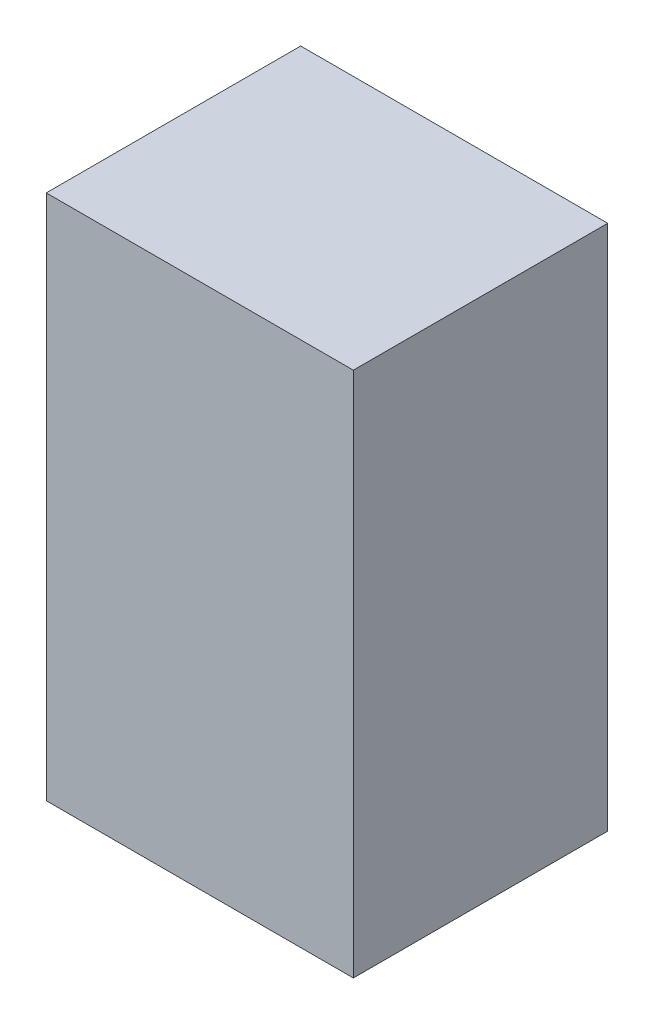
ISO-10303-21;
HEADER;
FILE_DESCRIPTION(('STEP AP214'),'2;1');
FILE_NAME('part.step','',(''),(''),'','','');
FILE_SCHEMA(('AUTOMOTIVE_DESIGN { 1 0 10303 214 1 1 1 1 }'));
ENDSEC;
DATA;
#1=APPLICATION_CONTEXT('core data for automotive mechanical design processes');
#2=APPLICATION_PROTOCOL_DEFINITION('international standard','automotive_design',2000,#1);
#3=PRODUCT_CONTEXT('',#1,'mechanical');
#4=PRODUCT('Part','Part','',(#3));
#5=PRODUCT_RELATED_PRODUCT_CATEGORY('part','',(#4));
#6=PRODUCT_DEFINITION_FORMATION('','',#4);
#7=PRODUCT_DEFINITION_CONTEXT('part definition',#1,'design');
#8=PRODUCT_DEFINITION('design','',#6,#7);
#9=PRODUCT_DEFINITION_SHAPE('','',#8);
#10=(LENGTH_UNIT() NAMED_UNIT(*) SI_UNIT(.MILLI.,.METRE.));
#11=(NAMED_UNIT(*) PLANE_ANGLE_UNIT() SI_UNIT($,.RADIAN.));
#12=(NAMED_UNIT(*) SI_UNIT($,.STERADIAN.) SOLID_ANGLE_UNIT());
#13=UNCERTAINTY_MEASURE_WITH_UNIT(LENGTH_MEASURE(1.E-05),#10,'distance_accuracy_value','');
#14=(GEOMETRIC_REPRESENTATION_CONTEXT(3) GLOBAL_UNCERTAINTY_ASSIGNED_CONTEXT((#13)) GLOBAL_UNIT_ASSIGNED_CONTEXT((#10,
#11,#12)) REPRESENTATION_CONTEXT('',''));
#15=CARTESIAN_POINT('',(0.,0.,0.));
#16=DIRECTION('',(0.,0.,1.));
#17=DIRECTION('',(1.,0.,0.));
#18=AXIS2_PLACEMENT_3D('',#15,#16,#17);
#19=CARTESIAN_POINT('',(-0.87499952,1.49999954,0.));
#20=DIRECTION('',(1.,0.,0.));
#21=DIRECTION('',(0.,-1.,0.));
#22=AXIS2_PLACEMENT_3D('',#19,#20,#21);
#23=PLANE('',#22);
#24=DIRECTION('',(0.,-1.,0.));
#25=VECTOR('',#24,1.);
#26=CARTESIAN_POINT('',(-0.87499952,1.49999954,0.));
#27=LINE('',#26,#25);
#28=CARTESIAN_POINT('',(-0.87499952,1.49999954,0.));
#29=VERTEX_POINT('',#28);
#30=CARTESIAN_POINT('',(-0.87499952,-1.49999954,0.));
#31=VERTEX_POINT('',#30);
#32=EDGE_CURVE('E11',#29,#31,#27,.T.);
#33=ORIENTED_EDGE('',*,*,#32,.T.);
#34=DIRECTION('',(0.,0.,1.));
#35=VECTOR('',#34,1.);
#36=CARTESIAN_POINT('',(-0.87499952,-1.49999954,0.));
#37=LINE('',#36,#35);
#38=CARTESIAN_POINT('',(-0.87499952,-1.49999954,1.44999964));
#39=VERTEX_POINT('',#38);
#40=EDGE_CURVE('E23',#31,#39,#37,.T.);
#41=ORIENTED_EDGE('',*,*,#40,.T.);
#42=DIRECTION('',(0.,-1.,0.));
#43=VECTOR('',#42,1.);
#44=CARTESIAN_POINT('',(-0.87499952,1.49999954,1.44999964));
#45=LINE('',#44,#43);
#46=CARTESIAN_POINT('',(-0.87499952,1.49999954,1.44999964));
#47=VERTEX_POINT('',#46);
#48=EDGE_CURVE('E86',#47,#39,#45,.T.);
#49=ORIENTED_EDGE('',*,*,#48,.F.);
#50=DIRECTION('',(0.,0.,1.));
#51=VECTOR('',#50,1.);
#52=CARTESIAN_POINT('',(-0.87499952,1.49999954,0.));
#53=LINE('',#52,#51);
#54=EDGE_CURVE('E35',#29,#47,#53,.T.);
#55=ORIENTED_EDGE('',*,*,#54,.F.);
#56=EDGE_LOOP('',(#33,#41,#49,#55));
#57=FACE_BOUND('',#56,.T.);
#58=ADVANCED_FACE('F16',(#57),#23,.F.);
#59=CARTESIAN_POINT('',(-0.87499952,-1.49999954,0.));
#60=DIRECTION('',(0.,1.,0.));
#61=DIRECTION('',(1.,0.,0.));
#62=AXIS2_PLACEMENT_3D('',#59,#60,#61);
#63=PLANE('',#62);
#64=DIRECTION('',(1.,0.,0.));
#65=VECTOR('',#64,1.);
#66=CARTESIAN_POINT('',(-0.87499952,-1.49999954,0.));
#67=LINE('',#66,#65);
#68=CARTESIAN_POINT('',(0.87499952,-1.49999954,0.));
#69=VERTEX_POINT('',#68);
#70=EDGE_CURVE('E83',#31,#69,#67,.T.);
#71=ORIENTED_EDGE('',*,*,#70,.T.);
#72=DIRECTION('',(0.,0.,1.));
#73=VECTOR('',#72,1.);
#74=CARTESIAN_POINT('',(0.87499952,-1.49999954,0.));
#75=LINE('',#74,#73);
#76=CARTESIAN_POINT('',(0.87499952,-1.49999954,1.44999964));
#77=VERTEX_POINT('',#76);
#78=EDGE_CURVE('E81',#69,#77,#75,.T.);
#79=ORIENTED_EDGE('',*,*,#78,.T.);
#80=DIRECTION('',(1.,0.,0.));
#81=VECTOR('',#80,1.);
#82=CARTESIAN_POINT('',(-0.87499952,-1.49999954,1.44999964));
#83=LINE('',#82,#81);
#84=EDGE_CURVE('E61',#39,#77,#83,.T.);
#85=ORIENTED_EDGE('',*,*,#84,.F.);
#86=ORIENTED_EDGE('',*,*,#40,.F.);
#87=EDGE_LOOP('',(#71,#79,#85,#86));
#88=FACE_BOUND('',#87,.T.);
#89=ADVANCED_FACE('F88',(#88),#63,.F.);
#90=CARTESIAN_POINT('',(0.87499952,-1.49999954,0.));
#91=DIRECTION('',(-1.,0.,0.));
#92=DIRECTION('',(0.,1.,0.));
#93=AXIS2_PLACEMENT_3D('',#90,#91,#92);
#94=PLANE('',#93);
#95=DIRECTION('',(0.,1.,0.));
#96=VECTOR('',#95,1.);
#97=CARTESIAN_POINT('',(0.87499952,-1.49999954,0.));
#98=LINE('',#97,#96);
#99=CARTESIAN_POINT('',(0.87499952,1.49999954,0.));
#100=VERTEX_POINT('',#99);
#101=EDGE_CURVE('E70',#69,#100,#98,.T.);
#102=ORIENTED_EDGE('',*,*,#101,.T.);
#103=DIRECTION('',(0.,0.,1.));
#104=VECTOR('',#103,1.);
#105=CARTESIAN_POINT('',(0.87499952,1.49999954,0.));
#106=LINE('',#105,#104);
#107=CARTESIAN_POINT('',(0.87499952,1.49999954,1.44999964));
#108=VERTEX_POINT('',#107);
#109=EDGE_CURVE('E64',#100,#108,#106,.T.);
#110=ORIENTED_EDGE('',*,*,#109,.T.);
#111=DIRECTION('',(0.,1.,0.));
#112=VECTOR('',#111,1.);
#113=CARTESIAN_POINT('',(0.87499952,-1.49999954,1.44999964));
#114=LINE('',#113,#112);
#115=EDGE_CURVE('E56',#77,#108,#114,.T.);
#116=ORIENTED_EDGE('',*,*,#115,.F.);
#117=ORIENTED_EDGE('',*,*,#78,.F.);
#118=EDGE_LOOP('',(#102,#110,#116,#117));
#119=FACE_BOUND('',#118,.T.);
#120=ADVANCED_FACE('F68',(#119),#94,.F.);
#121=CARTESIAN_POINT('',(0.87499952,1.49999954,0.));
#122=DIRECTION('',(0.,-1.,0.));
#123=DIRECTION('',(-1.,0.,0.));
#124=AXIS2_PLACEMENT_3D('',#121,#122,#123);
#125=PLANE('',#124);
#126=DIRECTION('',(-1.,0.,0.));
#127=VECTOR('',#126,1.);
#128=CARTESIAN_POINT('',(0.87499952,1.49999954,0.));
#129=LINE('',#128,#127);
#130=EDGE_CURVE('E65',#100,#29,#129,.T.);
#131=ORIENTED_EDGE('',*,*,#130,.T.);
#132=ORIENTED_EDGE('',*,*,#54,.T.);
#133=DIRECTION('',(-1.,0.,0.));
#134=VECTOR('',#133,1.);
#135=CARTESIAN_POINT('',(0.87499952,1.49999954,1.44999964));
#136=LINE('',#135,#134);
#137=EDGE_CURVE('E60',#108,#47,#136,.T.);
#138=ORIENTED_EDGE('',*,*,#137,.F.);
#139=ORIENTED_EDGE('',*,*,#109,.F.);
#140=EDGE_LOOP('',(#131,#132,#138,#139));
#141=FACE_BOUND('',#140,.T.);
#142=ADVANCED_FACE('F75',(#141),#125,.F.);
#143=CARTESIAN_POINT('',(-0.87499952,1.49999954,0.));
#144=DIRECTION('',(0.,0.,-1.));
#145=DIRECTION('',(-1.,0.,0.));
#146=AXIS2_PLACEMENT_3D('',#143,#144,#145);
#147=PLANE('',#146);
#148=ORIENTED_EDGE('',*,*,#130,.F.);
#149=ORIENTED_EDGE('',*,*,#101,.F.);
#150=ORIENTED_EDGE('',*,*,#70,.F.);
#151=ORIENTED_EDGE('',*,*,#32,.F.);
#152=EDGE_LOOP('',(#148,#149,#150,#151));
#153=FACE_BOUND('',#152,.T.);
#154=ADVANCED_FACE('F90',(#153),#147,.T.);
#155=CARTESIAN_POINT('',(-0.87499952,1.49999954,1.44999964));
#156=DIRECTION('',(0.,0.,-1.));
#157=DIRECTION('',(-1.,0.,0.));
#158=AXIS2_PLACEMENT_3D('',#155,#156,#157);
#159=PLANE('',#158);
#160=ORIENTED_EDGE('',*,*,#48,.T.);
#161=ORIENTED_EDGE('',*,*,#84,.T.);
#162=ORIENTED_EDGE('',*,*,#115,.T.);
#163=ORIENTED_EDGE('',*,*,#137,.T.);
#164=EDGE_LOOP('',(#160,#161,#162,#163));
#165=FACE_BOUND('',#164,.T.);
#166=ADVANCED_FACE('F58',(#165),#159,.F.);
#167=CLOSED_SHELL('',(#58,#89,#120,#142,#154,#166));
#168=MANIFOLD_SOLID_BREP('B1',#167);
#169=ADVANCED_BREP_SHAPE_REPRESENTATION('',(#18,#168),#14);
#170=SHAPE_DEFINITION_REPRESENTATION(#9,#169);
ENDSEC;
END-ISO-10303-21;
